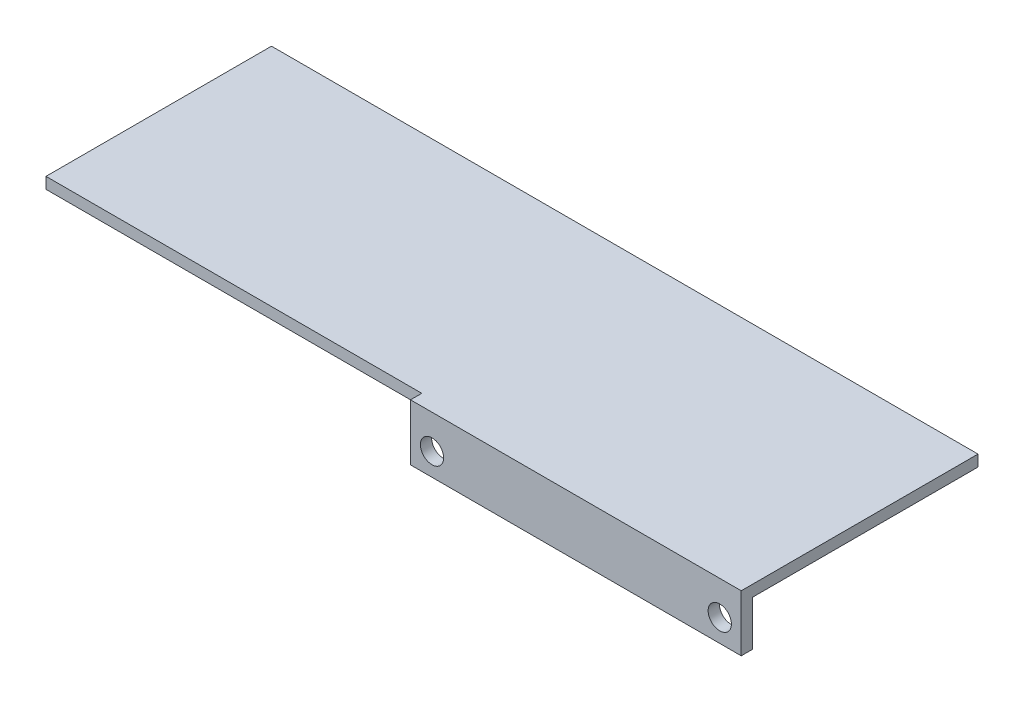
ISO-10303-21;
HEADER;
FILE_DESCRIPTION(('STEP AP214'),'2;1');
FILE_NAME('part.step','',(''),(''),'','','');
FILE_SCHEMA(('AUTOMOTIVE_DESIGN { 1 0 10303 214 1 1 1 1 }'));
ENDSEC;
DATA;
#1=APPLICATION_CONTEXT('core data for automotive mechanical design processes');
#2=APPLICATION_PROTOCOL_DEFINITION('international standard','automotive_design',2000,#1);
#3=PRODUCT_CONTEXT('',#1,'mechanical');
#4=PRODUCT('Part','Part','',(#3));
#5=PRODUCT_RELATED_PRODUCT_CATEGORY('part','',(#4));
#6=PRODUCT_DEFINITION_FORMATION('','',#4);
#7=PRODUCT_DEFINITION_CONTEXT('part definition',#1,'design');
#8=PRODUCT_DEFINITION('design','',#6,#7);
#9=PRODUCT_DEFINITION_SHAPE('','',#8);
#10=(LENGTH_UNIT() NAMED_UNIT(*) SI_UNIT(.MILLI.,.METRE.));
#11=(NAMED_UNIT(*) PLANE_ANGLE_UNIT() SI_UNIT($,.RADIAN.));
#12=(NAMED_UNIT(*) SI_UNIT($,.STERADIAN.) SOLID_ANGLE_UNIT());
#13=UNCERTAINTY_MEASURE_WITH_UNIT(LENGTH_MEASURE(1.E-05),#10,'distance_accuracy_value','');
#14=(GEOMETRIC_REPRESENTATION_CONTEXT(3) GLOBAL_UNCERTAINTY_ASSIGNED_CONTEXT((#13)) GLOBAL_UNIT_ASSIGNED_CONTEXT((#10,
#11,#12)) REPRESENTATION_CONTEXT('',''));
#15=CARTESIAN_POINT('',(0.,0.,0.));
#16=DIRECTION('',(0.,0.,1.));
#17=DIRECTION('',(1.,0.,0.));
#18=AXIS2_PLACEMENT_3D('',#15,#16,#17);
#19=CARTESIAN_POINT('',(-22.,-2.99999999999999,1.5));
#20=DIRECTION('',(1.,0.,0.));
#21=DIRECTION('',(0.,0.,-1.));
#22=AXIS2_PLACEMENT_3D('',#19,#20,#21);
#23=PLANE('',#22);
#24=DIRECTION('',(0.,1.,0.));
#25=VECTOR('',#24,1.);
#26=CARTESIAN_POINT('',(-22.,4.5,0.));
#27=LINE('',#26,#25);
#28=CARTESIAN_POINT('',(-22.,3.,0.));
#29=VERTEX_POINT('',#28);
#30=CARTESIAN_POINT('',(-22.,4.5,0.));
#31=VERTEX_POINT('',#30);
#32=EDGE_CURVE('E132',#29,#31,#27,.T.);
#33=ORIENTED_EDGE('',*,*,#32,.F.);
#34=DIRECTION('',(0.,-1.,0.));
#35=VECTOR('',#34,1.);
#36=CARTESIAN_POINT('',(-22.,-2.99999999999999,0.));
#37=LINE('',#36,#35);
#38=CARTESIAN_POINT('',(-22.,-2.99999999999999,0.));
#39=VERTEX_POINT('',#38);
#40=EDGE_CURVE('E76',#29,#39,#37,.T.);
#41=ORIENTED_EDGE('',*,*,#40,.T.);
#42=DIRECTION('',(0.,0.,-1.));
#43=VECTOR('',#42,1.);
#44=CARTESIAN_POINT('',(-22.,-2.99999999999999,1.5));
#45=LINE('',#44,#43);
#46=CARTESIAN_POINT('',(-22.,-2.99999999999999,1.5));
#47=VERTEX_POINT('',#46);
#48=EDGE_CURVE('E11',#47,#39,#45,.T.);
#49=ORIENTED_EDGE('',*,*,#48,.F.);
#50=DIRECTION('',(0.,-1.,0.));
#51=VECTOR('',#50,1.);
#52=CARTESIAN_POINT('',(-22.,-2.99999999999999,1.5));
#53=LINE('',#52,#51);
#54=CARTESIAN_POINT('',(-22.,4.5,1.5));
#55=VERTEX_POINT('',#54);
#56=EDGE_CURVE('E85',#55,#47,#53,.T.);
#57=ORIENTED_EDGE('',*,*,#56,.F.);
#58=DIRECTION('',(0.,0.,1.));
#59=VECTOR('',#58,1.);
#60=CARTESIAN_POINT('',(-22.,4.5,0.));
#61=LINE('',#60,#59);
#62=EDGE_CURVE('E110',#31,#55,#61,.T.);
#63=ORIENTED_EDGE('',*,*,#62,.F.);
#64=EDGE_LOOP('',(#33,#41,#49,#57,#63));
#65=FACE_BOUND('',#64,.T.);
#66=ADVANCED_FACE('F35',(#65),#23,.F.);
#67=CARTESIAN_POINT('',(0.,0.,0.));
#68=DIRECTION('',(0.,0.,1.));
#69=DIRECTION('',(1.,0.,0.));
#70=AXIS2_PLACEMENT_3D('',#67,#68,#69);
#71=PLANE('',#70);
#72=CARTESIAN_POINT('',(19.14418972,0.,0.));
#73=DIRECTION('',(0.,0.,1.));
#74=DIRECTION('',(1.,0.,0.));
#75=AXIS2_PLACEMENT_3D('',#72,#73,#74);
#76=CIRCLE('',#75,1.55);
#77=CARTESIAN_POINT('',(20.69418972,0.,0.));
#78=VERTEX_POINT('',#77);
#79=EDGE_CURVE('E99',#78,#78,#76,.T.);
#80=ORIENTED_EDGE('',*,*,#79,.T.);
#81=EDGE_LOOP('',(#80));
#82=FACE_BOUND('',#81,.T.);
#83=CARTESIAN_POINT('',(-19.14418972,0.,0.));
#84=DIRECTION('',(0.,0.,1.));
#85=DIRECTION('',(1.,0.,0.));
#86=AXIS2_PLACEMENT_3D('',#83,#84,#85);
#87=CIRCLE('',#86,1.55);
#88=CARTESIAN_POINT('',(-17.59418972,0.,0.));
#89=VERTEX_POINT('',#88);
#90=EDGE_CURVE('E93',#89,#89,#87,.T.);
#91=ORIENTED_EDGE('',*,*,#90,.T.);
#92=EDGE_LOOP('',(#91));
#93=FACE_BOUND('',#92,.T.);
#94=DIRECTION('',(-1.,0.,0.));
#95=VECTOR('',#94,1.);
#96=CARTESIAN_POINT('',(22.,3.,0.));
#97=LINE('',#96,#95);
#98=CARTESIAN_POINT('',(22.,3.,0.));
#99=VERTEX_POINT('',#98);
#100=EDGE_CURVE('E49',#99,#29,#97,.T.);
#101=ORIENTED_EDGE('',*,*,#100,.F.);
#102=DIRECTION('',(0.,1.,0.));
#103=VECTOR('',#102,1.);
#104=CARTESIAN_POINT('',(22.,-3.,0.));
#105=LINE('',#104,#103);
#106=CARTESIAN_POINT('',(22.,-3.,0.));
#107=VERTEX_POINT('',#106);
#108=EDGE_CURVE('E75',#107,#99,#105,.T.);
#109=ORIENTED_EDGE('',*,*,#108,.F.);
#110=DIRECTION('',(1.,0.,0.));
#111=VECTOR('',#110,1.);
#112=CARTESIAN_POINT('',(22.,-3.,0.));
#113=LINE('',#112,#111);
#114=EDGE_CURVE('E70',#39,#107,#113,.T.);
#115=ORIENTED_EDGE('',*,*,#114,.F.);
#116=ORIENTED_EDGE('',*,*,#40,.F.);
#117=EDGE_LOOP('',(#101,#109,#115,#116));
#118=FACE_BOUND('',#117,.T.);
#119=ADVANCED_FACE('F84',(#82,#93,#118),#71,.F.);
#120=CARTESIAN_POINT('',(0.,0.,1.5));
#121=DIRECTION('',(0.,0.,1.));
#122=DIRECTION('',(1.,0.,0.));
#123=AXIS2_PLACEMENT_3D('',#120,#121,#122);
#124=PLANE('',#123);
#125=CARTESIAN_POINT('',(-19.14418972,0.,1.5));
#126=DIRECTION('',(0.,0.,1.));
#127=DIRECTION('',(1.,0.,0.));
#128=AXIS2_PLACEMENT_3D('',#125,#126,#127);
#129=CIRCLE('',#128,1.55);
#130=CARTESIAN_POINT('',(-17.59418972,0.,1.5));
#131=VERTEX_POINT('',#130);
#132=EDGE_CURVE('E90',#131,#131,#129,.T.);
#133=ORIENTED_EDGE('',*,*,#132,.F.);
#134=EDGE_LOOP('',(#133));
#135=FACE_BOUND('',#134,.T.);
#136=ORIENTED_EDGE('',*,*,#56,.T.);
#137=DIRECTION('',(1.,0.,0.));
#138=VECTOR('',#137,1.);
#139=CARTESIAN_POINT('',(22.,-3.,1.5));
#140=LINE('',#139,#138);
#141=CARTESIAN_POINT('',(22.,-3.,1.5));
#142=VERTEX_POINT('',#141);
#143=EDGE_CURVE('E58',#47,#142,#140,.T.);
#144=ORIENTED_EDGE('',*,*,#143,.T.);
#145=DIRECTION('',(0.,1.,0.));
#146=VECTOR('',#145,1.);
#147=CARTESIAN_POINT('',(22.,-3.,1.5));
#148=LINE('',#147,#146);
#149=CARTESIAN_POINT('',(22.,4.5,1.5));
#150=VERTEX_POINT('',#149);
#151=EDGE_CURVE('E83',#142,#150,#148,.T.);
#152=ORIENTED_EDGE('',*,*,#151,.T.);
#153=DIRECTION('',(1.,0.,0.));
#154=VECTOR('',#153,1.);
#155=CARTESIAN_POINT('',(-22.,4.5,1.5));
#156=LINE('',#155,#154);
#157=EDGE_CURVE('E107',#55,#150,#156,.T.);
#158=ORIENTED_EDGE('',*,*,#157,.F.);
#159=EDGE_LOOP('',(#136,#144,#152,#158));
#160=FACE_BOUND('',#159,.T.);
#161=CARTESIAN_POINT('',(19.14418972,0.,1.5));
#162=DIRECTION('',(0.,0.,1.));
#163=DIRECTION('',(1.,0.,0.));
#164=AXIS2_PLACEMENT_3D('',#161,#162,#163);
#165=CIRCLE('',#164,1.55);
#166=CARTESIAN_POINT('',(20.69418972,0.,1.5));
#167=VERTEX_POINT('',#166);
#168=EDGE_CURVE('E96',#167,#167,#165,.T.);
#169=ORIENTED_EDGE('',*,*,#168,.F.);
#170=EDGE_LOOP('',(#169));
#171=FACE_BOUND('',#170,.T.);
#172=ADVANCED_FACE('F178',(#135,#160,#171),#124,.T.);
#173=CARTESIAN_POINT('',(22.,-3.,1.5));
#174=DIRECTION('',(0.,1.,0.));
#175=DIRECTION('',(-1.,0.,0.));
#176=AXIS2_PLACEMENT_3D('',#173,#174,#175);
#177=PLANE('',#176);
#178=ORIENTED_EDGE('',*,*,#114,.T.);
#179=DIRECTION('',(0.,0.,-1.));
#180=VECTOR('',#179,1.);
#181=CARTESIAN_POINT('',(22.,-3.,1.5));
#182=LINE('',#181,#180);
#183=EDGE_CURVE('E42',#142,#107,#182,.T.);
#184=ORIENTED_EDGE('',*,*,#183,.F.);
#185=ORIENTED_EDGE('',*,*,#143,.F.);
#186=ORIENTED_EDGE('',*,*,#48,.T.);
#187=EDGE_LOOP('',(#178,#184,#185,#186));
#188=FACE_BOUND('',#187,.T.);
#189=ADVANCED_FACE('F72',(#188),#177,.F.);
#190=CARTESIAN_POINT('',(22.,-3.,1.5));
#191=DIRECTION('',(-1.,0.,0.));
#192=DIRECTION('',(0.,0.,1.));
#193=AXIS2_PLACEMENT_3D('',#190,#191,#192);
#194=PLANE('',#193);
#195=ORIENTED_EDGE('',*,*,#108,.T.);
#196=DIRECTION('',(0.,0.,1.));
#197=VECTOR('',#196,1.);
#198=CARTESIAN_POINT('',(22.,3.,-30.));
#199=LINE('',#198,#197);
#200=CARTESIAN_POINT('',(22.,3.,-30.));
#201=VERTEX_POINT('',#200);
#202=EDGE_CURVE('E113',#201,#99,#199,.T.);
#203=ORIENTED_EDGE('',*,*,#202,.F.);
#204=DIRECTION('',(0.,-1.,0.));
#205=VECTOR('',#204,1.);
#206=CARTESIAN_POINT('',(22.,4.5,-30.));
#207=LINE('',#206,#205);
#208=CARTESIAN_POINT('',(22.,4.5,-30.));
#209=VERTEX_POINT('',#208);
#210=EDGE_CURVE('E117',#209,#201,#207,.T.);
#211=ORIENTED_EDGE('',*,*,#210,.F.);
#212=DIRECTION('',(0.,0.,-1.));
#213=VECTOR('',#212,1.);
#214=CARTESIAN_POINT('',(22.,4.5,0.));
#215=LINE('',#214,#213);
#216=EDGE_CURVE('E102',#150,#209,#215,.T.);
#217=ORIENTED_EDGE('',*,*,#216,.F.);
#218=ORIENTED_EDGE('',*,*,#151,.F.);
#219=ORIENTED_EDGE('',*,*,#183,.T.);
#220=EDGE_LOOP('',(#195,#203,#211,#217,#218,#219));
#221=FACE_BOUND('',#220,.T.);
#222=ADVANCED_FACE('F79',(#221),#194,.F.);
#223=CARTESIAN_POINT('',(-19.14418972,0.,1.5));
#224=DIRECTION('',(0.,0.,-1.));
#225=DIRECTION('',(-1.,0.,0.));
#226=AXIS2_PLACEMENT_3D('',#223,#224,#225);
#227=CYLINDRICAL_SURFACE('',#226,1.55);
#228=ORIENTED_EDGE('',*,*,#132,.T.);
#229=EDGE_LOOP('',(#228));
#230=FACE_BOUND('',#229,.T.);
#231=ORIENTED_EDGE('',*,*,#90,.F.);
#232=EDGE_LOOP('',(#231));
#233=FACE_BOUND('',#232,.T.);
#234=ADVANCED_FACE('F204',(#230,#233),#227,.F.);
#235=CARTESIAN_POINT('',(19.14418972,0.,1.5));
#236=DIRECTION('',(0.,0.,-1.));
#237=DIRECTION('',(-1.,0.,0.));
#238=AXIS2_PLACEMENT_3D('',#235,#236,#237);
#239=CYLINDRICAL_SURFACE('',#238,1.55);
#240=ORIENTED_EDGE('',*,*,#168,.T.);
#241=EDGE_LOOP('',(#240));
#242=FACE_BOUND('',#241,.T.);
#243=ORIENTED_EDGE('',*,*,#79,.F.);
#244=EDGE_LOOP('',(#243));
#245=FACE_BOUND('',#244,.T.);
#246=ADVANCED_FACE('F220',(#242,#245),#239,.F.);
#247=CARTESIAN_POINT('',(0.,4.5,0.));
#248=DIRECTION('',(0.,1.,0.));
#249=DIRECTION('',(-1.,0.,0.));
#250=AXIS2_PLACEMENT_3D('',#247,#248,#249);
#251=PLANE('',#250);
#252=DIRECTION('',(1.,0.,0.));
#253=VECTOR('',#252,1.);
#254=CARTESIAN_POINT('',(22.,4.5,-30.));
#255=LINE('',#254,#253);
#256=CARTESIAN_POINT('',(-72.,4.5,-30.));
#257=VERTEX_POINT('',#256);
#258=EDGE_CURVE('E115',#257,#209,#255,.T.);
#259=ORIENTED_EDGE('',*,*,#258,.F.);
#260=DIRECTION('',(0.,0.,-1.));
#261=VECTOR('',#260,1.);
#262=CARTESIAN_POINT('',(-72.,4.5,-30.));
#263=LINE('',#262,#261);
#264=CARTESIAN_POINT('',(-72.,4.5,0.));
#265=VERTEX_POINT('',#264);
#266=EDGE_CURVE('E131',#265,#257,#263,.T.);
#267=ORIENTED_EDGE('',*,*,#266,.F.);
#268=DIRECTION('',(1.,0.,0.));
#269=VECTOR('',#268,1.);
#270=CARTESIAN_POINT('',(-72.,4.5,0.));
#271=LINE('',#270,#269);
#272=EDGE_CURVE('E128',#265,#31,#271,.T.);
#273=ORIENTED_EDGE('',*,*,#272,.T.);
#274=ORIENTED_EDGE('',*,*,#62,.T.);
#275=ORIENTED_EDGE('',*,*,#157,.T.);
#276=ORIENTED_EDGE('',*,*,#216,.T.);
#277=EDGE_LOOP('',(#259,#267,#273,#274,#275,#276));
#278=FACE_BOUND('',#277,.T.);
#279=ADVANCED_FACE('F180',(#278),#251,.T.);
#280=CARTESIAN_POINT('',(22.,3.,-30.));
#281=DIRECTION('',(0.,1.,0.));
#282=DIRECTION('',(0.,0.,1.));
#283=AXIS2_PLACEMENT_3D('',#280,#281,#282);
#284=PLANE('',#283);
#285=ORIENTED_EDGE('',*,*,#100,.T.);
#286=DIRECTION('',(1.,0.,0.));
#287=VECTOR('',#286,1.);
#288=CARTESIAN_POINT('',(-72.,3.,0.));
#289=LINE('',#288,#287);
#290=CARTESIAN_POINT('',(-72.,3.,0.));
#291=VERTEX_POINT('',#290);
#292=EDGE_CURVE('E118',#291,#29,#289,.T.);
#293=ORIENTED_EDGE('',*,*,#292,.F.);
#294=DIRECTION('',(0.,0.,1.));
#295=VECTOR('',#294,1.);
#296=CARTESIAN_POINT('',(-72.,3.,-30.));
#297=LINE('',#296,#295);
#298=CARTESIAN_POINT('',(-72.,3.,-30.));
#299=VERTEX_POINT('',#298);
#300=EDGE_CURVE('E141',#299,#291,#297,.T.);
#301=ORIENTED_EDGE('',*,*,#300,.F.);
#302=DIRECTION('',(-1.,0.,0.));
#303=VECTOR('',#302,1.);
#304=CARTESIAN_POINT('',(22.,3.,-30.));
#305=LINE('',#304,#303);
#306=EDGE_CURVE('E121',#201,#299,#305,.T.);
#307=ORIENTED_EDGE('',*,*,#306,.F.);
#308=ORIENTED_EDGE('',*,*,#202,.T.);
#309=EDGE_LOOP('',(#285,#293,#301,#307,#308));
#310=FACE_BOUND('',#309,.T.);
#311=ADVANCED_FACE('F183',(#310),#284,.F.);
#312=CARTESIAN_POINT('',(0.,0.,-30.));
#313=DIRECTION('',(0.,0.,-1.));
#314=DIRECTION('',(-1.,0.,0.));
#315=AXIS2_PLACEMENT_3D('',#312,#313,#314);
#316=PLANE('',#315);
#317=ORIENTED_EDGE('',*,*,#210,.T.);
#318=ORIENTED_EDGE('',*,*,#306,.T.);
#319=DIRECTION('',(0.,-1.,0.));
#320=VECTOR('',#319,1.);
#321=CARTESIAN_POINT('',(-72.,4.5,-30.));
#322=LINE('',#321,#320);
#323=EDGE_CURVE('E135',#257,#299,#322,.T.);
#324=ORIENTED_EDGE('',*,*,#323,.F.);
#325=ORIENTED_EDGE('',*,*,#258,.T.);
#326=EDGE_LOOP('',(#317,#318,#324,#325));
#327=FACE_BOUND('',#326,.T.);
#328=ADVANCED_FACE('F157',(#327),#316,.T.);
#329=CARTESIAN_POINT('',(-72.,4.5,0.));
#330=DIRECTION('',(0.,0.,-1.));
#331=DIRECTION('',(-1.,0.,0.));
#332=AXIS2_PLACEMENT_3D('',#329,#330,#331);
#333=PLANE('',#332);
#334=ORIENTED_EDGE('',*,*,#32,.T.);
#335=ORIENTED_EDGE('',*,*,#272,.F.);
#336=DIRECTION('',(0.,1.,0.));
#337=VECTOR('',#336,1.);
#338=CARTESIAN_POINT('',(-72.,4.5,0.));
#339=LINE('',#338,#337);
#340=EDGE_CURVE('E138',#291,#265,#339,.T.);
#341=ORIENTED_EDGE('',*,*,#340,.F.);
#342=ORIENTED_EDGE('',*,*,#292,.T.);
#343=EDGE_LOOP('',(#334,#335,#341,#342));
#344=FACE_BOUND('',#343,.T.);
#345=ADVANCED_FACE('F187',(#344),#333,.F.);
#346=CARTESIAN_POINT('',(-72.,0.,0.));
#347=DIRECTION('',(-1.,0.,0.));
#348=DIRECTION('',(0.,0.,1.));
#349=AXIS2_PLACEMENT_3D('',#346,#347,#348);
#350=PLANE('',#349);
#351=ORIENTED_EDGE('',*,*,#323,.T.);
#352=ORIENTED_EDGE('',*,*,#300,.T.);
#353=ORIENTED_EDGE('',*,*,#340,.T.);
#354=ORIENTED_EDGE('',*,*,#266,.T.);
#355=EDGE_LOOP('',(#351,#352,#353,#354));
#356=FACE_BOUND('',#355,.T.);
#357=ADVANCED_FACE('F148',(#356),#350,.T.);
#358=CLOSED_SHELL('',(#66,#119,#172,#189,#222,#234,#246,#279,#311,#328,#345,#357));
#359=MANIFOLD_SOLID_BREP('B2',#358);
#360=ADVANCED_BREP_SHAPE_REPRESENTATION('',(#18,#359),#14);
#361=SHAPE_DEFINITION_REPRESENTATION(#9,#360);
ENDSEC;
END-ISO-10303-21;
